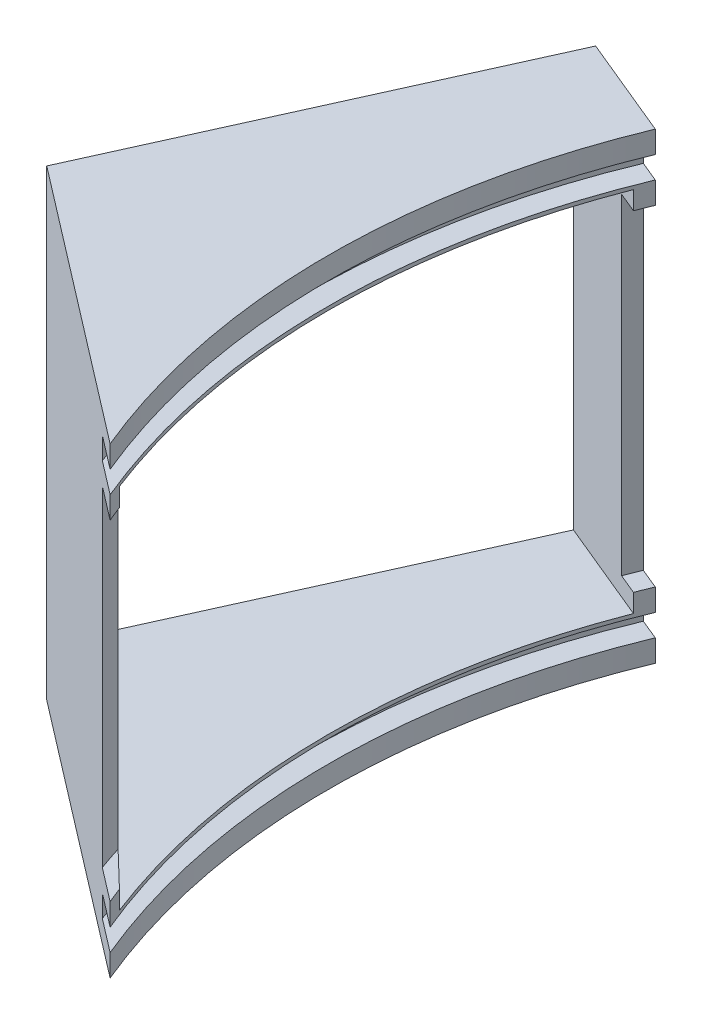
ISO-10303-21;
HEADER;
FILE_DESCRIPTION(('STEP AP214'),'2;1');
FILE_NAME('part.step','',(''),(''),'','','');
FILE_SCHEMA(('AUTOMOTIVE_DESIGN { 1 0 10303 214 1 1 1 1 }'));
ENDSEC;
DATA;
#1=APPLICATION_CONTEXT('core data for automotive mechanical design processes');
#2=APPLICATION_PROTOCOL_DEFINITION('international standard','automotive_design',2000,#1);
#3=PRODUCT_CONTEXT('',#1,'mechanical');
#4=PRODUCT('Part','Part','',(#3));
#5=PRODUCT_RELATED_PRODUCT_CATEGORY('part','',(#4));
#6=PRODUCT_DEFINITION_FORMATION('','',#4);
#7=PRODUCT_DEFINITION_CONTEXT('part definition',#1,'design');
#8=PRODUCT_DEFINITION('design','',#6,#7);
#9=PRODUCT_DEFINITION_SHAPE('','',#8);
#10=(LENGTH_UNIT() NAMED_UNIT(*) SI_UNIT(.MILLI.,.METRE.));
#11=(NAMED_UNIT(*) PLANE_ANGLE_UNIT() SI_UNIT($,.RADIAN.));
#12=(NAMED_UNIT(*) SI_UNIT($,.STERADIAN.) SOLID_ANGLE_UNIT());
#13=UNCERTAINTY_MEASURE_WITH_UNIT(LENGTH_MEASURE(1.E-05),#10,'distance_accuracy_value','');
#14=(GEOMETRIC_REPRESENTATION_CONTEXT(3) GLOBAL_UNCERTAINTY_ASSIGNED_CONTEXT((#13)) GLOBAL_UNIT_ASSIGNED_CONTEXT((#10,
#11,#12)) REPRESENTATION_CONTEXT('',''));
#15=CARTESIAN_POINT('',(0.,0.,0.));
#16=DIRECTION('',(0.,0.,1.));
#17=DIRECTION('',(1.,0.,0.));
#18=AXIS2_PLACEMENT_3D('',#15,#16,#17);
#19=CARTESIAN_POINT('',(-89.6163146535948,22.5,-37.1202929394138));
#20=DIRECTION('',(0.,-1.,0.));
#21=DIRECTION('',(0.,0.,-1.));
#22=AXIS2_PLACEMENT_3D('',#19,#20,#21);
#23=PLANE('',#22);
#24=DIRECTION('',(0.923879532511287,0.,0.382683432365091));
#25=VECTOR('',#24,1.);
#26=CARTESIAN_POINT('',(-90.4903063109859,22.5,-35.0102904267393));
#27=LINE('',#26,#25);
#28=CARTESIAN_POINT('',(-93.2378471168144,22.5,-36.148359091687));
#29=VERTEX_POINT('',#28);
#30=CARTESIAN_POINT('',(-90.4654630231892,22.5,-35.));
#31=VERTEX_POINT('',#30);
#32=EDGE_CURVE('E343',#29,#31,#27,.T.);
#33=ORIENTED_EDGE('',*,*,#32,.F.);
#34=CARTESIAN_POINT('',(0.,22.5,0.));
#35=DIRECTION('',(0.,1.,0.));
#36=DIRECTION('',(0.,0.,1.));
#37=AXIS2_PLACEMENT_3D('',#34,#35,#36);
#38=CIRCLE('',#37,100.);
#39=CARTESIAN_POINT('',(-92.3879532511287,22.5,-38.2683432365091));
#40=VERTEX_POINT('',#39);
#41=EDGE_CURVE('E288',#40,#29,#38,.T.);
#42=ORIENTED_EDGE('',*,*,#41,.F.);
#43=DIRECTION('',(0.923879532511287,0.,0.382683432365091));
#44=VECTOR('',#43,1.);
#45=CARTESIAN_POINT('',(-89.6163146535948,22.5,-37.1202929394138));
#46=LINE('',#45,#44);
#47=CARTESIAN_POINT('',(-89.6163146535948,22.5,-37.1202929394138));
#48=VERTEX_POINT('',#47);
#49=EDGE_CURVE('E245',#40,#48,#46,.T.);
#50=ORIENTED_EDGE('',*,*,#49,.T.);
#51=CARTESIAN_POINT('',(0.,22.5,0.));
#52=DIRECTION('',(0.,1.,0.));
#53=DIRECTION('',(0.,0.,1.));
#54=AXIS2_PLACEMENT_3D('',#51,#52,#53);
#55=CIRCLE('',#54,97.);
#56=EDGE_CURVE('E292',#48,#31,#55,.T.);
#57=ORIENTED_EDGE('',*,*,#56,.T.);
#58=EDGE_LOOP('',(#33,#42,#50,#57));
#59=FACE_BOUND('',#58,.T.);
#60=ADVANCED_FACE('F33',(#59),#23,.T.);
#61=CARTESIAN_POINT('',(0.,55.,0.));
#62=DIRECTION('',(0.,1.,0.));
#63=DIRECTION('',(0.,0.,1.));
#64=AXIS2_PLACEMENT_3D('',#61,#62,#63);
#65=CYLINDRICAL_SURFACE('',#64,100.);
#66=DIRECTION('',(0.,1.,0.));
#67=VECTOR('',#66,1.);
#68=CARTESIAN_POINT('',(-93.2378471168144,55.,-36.148359091687));
#69=LINE('',#68,#67);
#70=CARTESIAN_POINT('',(-93.2378471168144,-22.5,-36.148359091687));
#71=VERTEX_POINT('',#70);
#72=EDGE_CURVE('E341',#71,#29,#69,.T.);
#73=ORIENTED_EDGE('',*,*,#72,.F.);
#74=CARTESIAN_POINT('',(0.,-22.5,0.));
#75=DIRECTION('',(0.,1.,0.));
#76=DIRECTION('',(0.,0.,1.));
#77=AXIS2_PLACEMENT_3D('',#74,#75,#76);
#78=CIRCLE('',#77,100.);
#79=CARTESIAN_POINT('',(-92.3879532511287,-22.5,-38.2683432365091));
#80=VERTEX_POINT('',#79);
#81=EDGE_CURVE('E284',#80,#71,#78,.T.);
#82=ORIENTED_EDGE('',*,*,#81,.F.);
#83=DIRECTION('',(0.,1.,0.));
#84=VECTOR('',#83,1.);
#85=CARTESIAN_POINT('',(-92.3879532511287,22.5,-38.2683432365091));
#86=LINE('',#85,#84);
#87=EDGE_CURVE('E242',#80,#40,#86,.T.);
#88=ORIENTED_EDGE('',*,*,#87,.T.);
#89=ORIENTED_EDGE('',*,*,#41,.T.);
#90=EDGE_LOOP('',(#73,#82,#88,#89));
#91=FACE_BOUND('',#90,.T.);
#92=ADVANCED_FACE('F442',(#91),#65,.F.);
#93=CARTESIAN_POINT('',(-92.3879532511287,-22.5,-38.2683432365091));
#94=DIRECTION('',(0.,1.,0.));
#95=DIRECTION('',(0.,0.,1.));
#96=AXIS2_PLACEMENT_3D('',#93,#94,#95);
#97=PLANE('',#96);
#98=DIRECTION('',(-0.923879532511287,0.,-0.382683432365091));
#99=VECTOR('',#98,1.);
#100=CARTESIAN_POINT('',(-93.2619449085198,-22.5,-36.1583407238346));
#101=LINE('',#100,#99);
#102=CARTESIAN_POINT('',(-90.4654630231892,-22.5,-35.));
#103=VERTEX_POINT('',#102);
#104=EDGE_CURVE('E339',#103,#71,#101,.T.);
#105=ORIENTED_EDGE('',*,*,#104,.F.);
#106=CARTESIAN_POINT('',(0.,-22.5,0.));
#107=DIRECTION('',(0.,1.,0.));
#108=DIRECTION('',(0.,0.,1.));
#109=AXIS2_PLACEMENT_3D('',#106,#107,#108);
#110=CIRCLE('',#109,97.);
#111=CARTESIAN_POINT('',(-89.6163146535948,-22.5,-37.1202929394138));
#112=VERTEX_POINT('',#111);
#113=EDGE_CURVE('E280',#112,#103,#110,.T.);
#114=ORIENTED_EDGE('',*,*,#113,.F.);
#115=DIRECTION('',(-0.923879532511287,0.,-0.382683432365091));
#116=VECTOR('',#115,1.);
#117=CARTESIAN_POINT('',(-92.3879532511287,-22.5,-38.2683432365091));
#118=LINE('',#117,#116);
#119=EDGE_CURVE('E239',#112,#80,#118,.T.);
#120=ORIENTED_EDGE('',*,*,#119,.T.);
#121=ORIENTED_EDGE('',*,*,#81,.T.);
#122=EDGE_LOOP('',(#105,#114,#120,#121));
#123=FACE_BOUND('',#122,.T.);
#124=ADVANCED_FACE('F438',(#123),#97,.T.);
#125=CARTESIAN_POINT('',(-117.332700628933,31.5,-48.6007959103665));
#126=DIRECTION('',(0.,1.,0.));
#127=DIRECTION('',(0.,0.,1.));
#128=AXIS2_PLACEMENT_3D('',#125,#126,#127);
#129=PLANE('',#128);
#130=DIRECTION('',(0.411023274372276,0.,-0.911624850431521));
#131=VECTOR('',#130,1.);
#132=CARTESIAN_POINT('',(-103.474507641264,31.5,-42.8605444248902));
#133=LINE('',#132,#131);
#134=CARTESIAN_POINT('',(-126.704281868358,31.5,8.66169476624683));
#135=VERTEX_POINT('',#134);
#136=CARTESIAN_POINT('',(-103.474507641264,31.5,-42.8605444248902));
#137=VERTEX_POINT('',#136);
#138=EDGE_CURVE('E200',#135,#137,#133,.T.);
#139=ORIENTED_EDGE('',*,*,#138,.F.);
#140=DIRECTION('',(-0.793353340291234,0.,-0.608761429008722));
#141=VECTOR('',#140,1.);
#142=CARTESIAN_POINT('',(-126.704281868358,31.5,8.66169476624683));
#143=LINE('',#142,#141);
#144=CARTESIAN_POINT('',(-89.6163146535948,31.5,37.1202929394138));
#145=VERTEX_POINT('',#144);
#146=EDGE_CURVE('E416',#145,#135,#143,.T.);
#147=ORIENTED_EDGE('',*,*,#146,.F.);
#148=CARTESIAN_POINT('',(0.,31.5,0.));
#149=DIRECTION('',(0.,1.,0.));
#150=DIRECTION('',(0.,0.,1.));
#151=AXIS2_PLACEMENT_3D('',#148,#149,#150);
#152=CIRCLE('',#151,97.);
#153=CARTESIAN_POINT('',(-89.6163146535948,31.5,-37.1202929394138));
#154=VERTEX_POINT('',#153);
#155=EDGE_CURVE('E307',#154,#145,#152,.T.);
#156=ORIENTED_EDGE('',*,*,#155,.F.);
#157=DIRECTION('',(-0.923879532511287,0.,-0.382683432365091));
#158=VECTOR('',#157,1.);
#159=CARTESIAN_POINT('',(-117.332700628933,31.5,-48.6007959103665));
#160=LINE('',#159,#158);
#161=EDGE_CURVE('E263',#154,#137,#160,.T.);
#162=ORIENTED_EDGE('',*,*,#161,.T.);
#163=EDGE_LOOP('',(#139,#147,#156,#162));
#164=FACE_BOUND('',#163,.T.);
#165=ADVANCED_FACE('F35',(#164),#129,.T.);
#166=CARTESIAN_POINT('',(0.,55.,0.));
#167=DIRECTION('',(0.,1.,0.));
#168=DIRECTION('',(0.,0.,1.));
#169=AXIS2_PLACEMENT_3D('',#166,#167,#168);
#170=CYLINDRICAL_SURFACE('',#169,97.);
#171=CARTESIAN_POINT('',(0.,28.5,0.));
#172=DIRECTION('',(0.,1.,0.));
#173=DIRECTION('',(0.,0.,1.));
#174=AXIS2_PLACEMENT_3D('',#171,#172,#173);
#175=CIRCLE('',#174,97.);
#176=CARTESIAN_POINT('',(-89.6163146535948,28.5,-37.1202929394138));
#177=VERTEX_POINT('',#176);
#178=CARTESIAN_POINT('',(-89.6163146535948,28.5,37.1202929394138));
#179=VERTEX_POINT('',#178);
#180=EDGE_CURVE('E304',#177,#179,#175,.T.);
#181=ORIENTED_EDGE('',*,*,#180,.F.);
#182=DIRECTION('',(0.,1.,0.));
#183=VECTOR('',#182,1.);
#184=CARTESIAN_POINT('',(-89.6163146535948,31.5,-37.1202929394138));
#185=LINE('',#184,#183);
#186=EDGE_CURVE('E260',#177,#154,#185,.T.);
#187=ORIENTED_EDGE('',*,*,#186,.T.);
#188=ORIENTED_EDGE('',*,*,#155,.T.);
#189=DIRECTION('',(0.,1.,0.));
#190=VECTOR('',#189,1.);
#191=CARTESIAN_POINT('',(-89.6163146535948,31.5,37.1202929394138));
#192=LINE('',#191,#190);
#193=EDGE_CURVE('E220',#179,#145,#192,.T.);
#194=ORIENTED_EDGE('',*,*,#193,.F.);
#195=EDGE_LOOP('',(#181,#187,#188,#194));
#196=FACE_BOUND('',#195,.T.);
#197=ADVANCED_FACE('F465',(#196),#170,.F.);
#198=CARTESIAN_POINT('',(-89.6163146535948,28.5,-37.1202929394138));
#199=DIRECTION('',(0.,-1.,0.));
#200=DIRECTION('',(0.,0.,-1.));
#201=AXIS2_PLACEMENT_3D('',#198,#199,#200);
#202=PLANE('',#201);
#203=DIRECTION('',(0.793353340291234,0.,0.608761429008722));
#204=VECTOR('',#203,1.);
#205=CARTESIAN_POINT('',(-125.47176428319,28.5,9.60743877250481));
#206=LINE('',#205,#204);
#207=CARTESIAN_POINT('',(-94.17946734075,28.5,33.6188627322909));
#208=VERTEX_POINT('',#207);
#209=EDGE_CURVE('E374',#208,#179,#206,.T.);
#210=ORIENTED_EDGE('',*,*,#209,.F.);
#211=CARTESIAN_POINT('',(0.,28.5,0.));
#212=DIRECTION('',(0.,1.,0.));
#213=DIRECTION('',(0.,0.,1.));
#214=AXIS2_PLACEMENT_3D('',#211,#212,#213);
#215=CIRCLE('',#214,100.);
#216=CARTESIAN_POINT('',(-92.3879532511287,28.5,-38.2683432365091));
#217=VERTEX_POINT('',#216);
#218=EDGE_CURVE('E301',#217,#208,#215,.T.);
#219=ORIENTED_EDGE('',*,*,#218,.F.);
#220=DIRECTION('',(0.923879532511287,0.,0.382683432365091));
#221=VECTOR('',#220,1.);
#222=CARTESIAN_POINT('',(-89.6163146535948,28.5,-37.1202929394138));
#223=LINE('',#222,#221);
#224=EDGE_CURVE('E257',#217,#177,#223,.T.);
#225=ORIENTED_EDGE('',*,*,#224,.T.);
#226=ORIENTED_EDGE('',*,*,#180,.T.);
#227=EDGE_LOOP('',(#210,#219,#225,#226));
#228=FACE_BOUND('',#227,.T.);
#229=ADVANCED_FACE('F463',(#228),#202,.T.);
#230=CARTESIAN_POINT('',(0.,55.,0.));
#231=DIRECTION('',(0.,1.,0.));
#232=DIRECTION('',(0.,0.,1.));
#233=AXIS2_PLACEMENT_3D('',#230,#231,#232);
#234=CYLINDRICAL_SURFACE('',#233,100.);
#235=DIRECTION('',(0.,1.,0.));
#236=VECTOR('',#235,1.);
#237=CARTESIAN_POINT('',(-94.17946734075,55.,33.6188627322909));
#238=LINE('',#237,#236);
#239=CARTESIAN_POINT('',(-94.17946734075,25.5,33.6188627322909));
#240=VERTEX_POINT('',#239);
#241=EDGE_CURVE('E361',#240,#208,#238,.T.);
#242=ORIENTED_EDGE('',*,*,#241,.F.);
#243=CARTESIAN_POINT('',(0.,25.5,0.));
#244=DIRECTION('',(0.,1.,0.));
#245=DIRECTION('',(0.,0.,1.));
#246=AXIS2_PLACEMENT_3D('',#243,#244,#245);
#247=CIRCLE('',#246,100.);
#248=CARTESIAN_POINT('',(-92.3879532511287,25.5,-38.2683432365091));
#249=VERTEX_POINT('',#248);
#250=EDGE_CURVE('E298',#249,#240,#247,.T.);
#251=ORIENTED_EDGE('',*,*,#250,.F.);
#252=DIRECTION('',(0.,1.,0.));
#253=VECTOR('',#252,1.);
#254=CARTESIAN_POINT('',(-92.3879532511287,28.5,-38.2683432365091));
#255=LINE('',#254,#253);
#256=EDGE_CURVE('E254',#249,#217,#255,.T.);
#257=ORIENTED_EDGE('',*,*,#256,.T.);
#258=ORIENTED_EDGE('',*,*,#218,.T.);
#259=EDGE_LOOP('',(#242,#251,#257,#258));
#260=FACE_BOUND('',#259,.T.);
#261=ADVANCED_FACE('F372',(#260),#234,.F.);
#262=CARTESIAN_POINT('',(-92.3879532511287,25.5,-38.2683432365091));
#263=DIRECTION('',(0.,1.,0.));
#264=DIRECTION('',(0.,0.,1.));
#265=AXIS2_PLACEMENT_3D('',#262,#263,#264);
#266=PLANE('',#265);
#267=DIRECTION('',(-0.793353340291234,0.,-0.608761429008722));
#268=VECTOR('',#267,1.);
#269=CARTESIAN_POINT('',(-127.77072572547,25.5,7.84338361352032));
#270=LINE('',#269,#268);
#271=CARTESIAN_POINT('',(-89.6163146535948,25.5,37.1202929394138));
#272=VERTEX_POINT('',#271);
#273=EDGE_CURVE('E352',#272,#240,#270,.T.);
#274=ORIENTED_EDGE('',*,*,#273,.F.);
#275=CARTESIAN_POINT('',(0.,25.5,0.));
#276=DIRECTION('',(0.,1.,0.));
#277=DIRECTION('',(0.,0.,1.));
#278=AXIS2_PLACEMENT_3D('',#275,#276,#277);
#279=CIRCLE('',#278,97.);
#280=CARTESIAN_POINT('',(-89.6163146535948,25.5,-37.1202929394138));
#281=VERTEX_POINT('',#280);
#282=EDGE_CURVE('E295',#281,#272,#279,.T.);
#283=ORIENTED_EDGE('',*,*,#282,.F.);
#284=DIRECTION('',(-0.923879532511287,0.,-0.382683432365091));
#285=VECTOR('',#284,1.);
#286=CARTESIAN_POINT('',(-92.3879532511287,25.5,-38.2683432365091));
#287=LINE('',#286,#285);
#288=EDGE_CURVE('E251',#281,#249,#287,.T.);
#289=ORIENTED_EDGE('',*,*,#288,.T.);
#290=ORIENTED_EDGE('',*,*,#250,.T.);
#291=EDGE_LOOP('',(#274,#283,#289,#290));
#292=FACE_BOUND('',#291,.T.);
#293=ADVANCED_FACE('F360',(#292),#266,.T.);
#294=CARTESIAN_POINT('',(0.,55.,0.));
#295=DIRECTION('',(0.,1.,0.));
#296=DIRECTION('',(0.,0.,1.));
#297=AXIS2_PLACEMENT_3D('',#294,#295,#296);
#298=CYLINDRICAL_SURFACE('',#297,97.);
#299=DIRECTION('',(0.,1.,0.));
#300=VECTOR('',#299,1.);
#301=CARTESIAN_POINT('',(-90.4654630231892,-25.,-35.));
#302=LINE('',#301,#300);
#303=CARTESIAN_POINT('',(-90.4654630231892,25.,-35.));
#304=VERTEX_POINT('',#303);
#305=EDGE_CURVE('E326',#31,#304,#302,.T.);
#306=ORIENTED_EDGE('',*,*,#305,.F.);
#307=ORIENTED_EDGE('',*,*,#56,.F.);
#308=DIRECTION('',(0.,1.,0.));
#309=VECTOR('',#308,1.);
#310=CARTESIAN_POINT('',(-89.6163146535948,25.5,-37.1202929394138));
#311=LINE('',#310,#309);
#312=EDGE_CURVE('E248',#48,#281,#311,.T.);
#313=ORIENTED_EDGE('',*,*,#312,.T.);
#314=ORIENTED_EDGE('',*,*,#282,.T.);
#315=DIRECTION('',(0.,1.,0.));
#316=VECTOR('',#315,1.);
#317=CARTESIAN_POINT('',(-89.6163146535948,25.5,37.1202929394138));
#318=LINE('',#317,#316);
#319=CARTESIAN_POINT('',(-89.6163146535948,22.5,37.1202929394138));
#320=VERTEX_POINT('',#319);
#321=EDGE_CURVE('E224',#320,#272,#318,.T.);
#322=ORIENTED_EDGE('',*,*,#321,.F.);
#323=CARTESIAN_POINT('',(-90.4654630231892,22.5,35.));
#324=VERTEX_POINT('',#323);
#325=EDGE_CURVE('E291',#324,#320,#55,.T.);
#326=ORIENTED_EDGE('',*,*,#325,.F.);
#327=DIRECTION('',(0.,1.,0.));
#328=VECTOR('',#327,1.);
#329=CARTESIAN_POINT('',(-90.4654630231892,-25.,35.));
#330=LINE('',#329,#328);
#331=CARTESIAN_POINT('',(-90.4654630231892,25.,35.));
#332=VERTEX_POINT('',#331);
#333=EDGE_CURVE('E322',#324,#332,#330,.T.);
#334=ORIENTED_EDGE('',*,*,#333,.T.);
#335=CARTESIAN_POINT('',(0.,25.,0.));
#336=DIRECTION('',(0.,-1.,0.));
#337=DIRECTION('',(0.,0.,-1.));
#338=AXIS2_PLACEMENT_3D('',#335,#336,#337);
#339=CIRCLE('',#338,97.);
#340=EDGE_CURVE('E11',#332,#304,#339,.T.);
#341=ORIENTED_EDGE('',*,*,#340,.T.);
#342=EDGE_LOOP('',(#306,#307,#313,#314,#322,#326,#334,#341));
#343=FACE_BOUND('',#342,.T.);
#344=ADVANCED_FACE('F364',(#343),#298,.F.);
#345=DIRECTION('',(0.793353340291234,0.,0.608761429008722));
#346=VECTOR('',#345,1.);
#347=CARTESIAN_POINT('',(-125.47176428319,22.5,9.60743877250481));
#348=LINE('',#347,#346);
#349=CARTESIAN_POINT('',(-94.17946734075,22.5,33.6188627322909));
#350=VERTEX_POINT('',#349);
#351=EDGE_CURVE('E355',#350,#320,#348,.T.);
#352=ORIENTED_EDGE('',*,*,#351,.F.);
#353=CARTESIAN_POINT('',(-95.2752769915698,22.5,30.3746867338523));
#354=VERTEX_POINT('',#353);
#355=EDGE_CURVE('E287',#354,#350,#38,.T.);
#356=ORIENTED_EDGE('',*,*,#355,.F.);
#357=DIRECTION('',(-0.720796216102948,0.,-0.693147036963784));
#358=VECTOR('',#357,1.);
#359=CARTESIAN_POINT('',(-126.056869691246,22.5,0.773851856884049));
#360=LINE('',#359,#358);
#361=EDGE_CURVE('E337',#324,#354,#360,.T.);
#362=ORIENTED_EDGE('',*,*,#361,.F.);
#363=ORIENTED_EDGE('',*,*,#325,.T.);
#364=EDGE_LOOP('',(#352,#356,#362,#363));
#365=FACE_BOUND('',#364,.T.);
#366=ADVANCED_FACE('F393',(#365),#23,.T.);
#367=DIRECTION('',(0.,1.,0.));
#368=VECTOR('',#367,1.);
#369=CARTESIAN_POINT('',(-94.17946734075,55.,33.6188627322909));
#370=LINE('',#369,#368);
#371=CARTESIAN_POINT('',(-94.17946734075,-22.5,33.6188627322909));
#372=VERTEX_POINT('',#371);
#373=EDGE_CURVE('E399',#372,#350,#370,.T.);
#374=ORIENTED_EDGE('',*,*,#373,.F.);
#375=CARTESIAN_POINT('',(-95.2752769915698,-22.5,30.3746867338523));
#376=VERTEX_POINT('',#375);
#377=EDGE_CURVE('E283',#376,#372,#78,.T.);
#378=ORIENTED_EDGE('',*,*,#377,.F.);
#379=DIRECTION('',(0.,1.,0.));
#380=VECTOR('',#379,1.);
#381=CARTESIAN_POINT('',(-95.2752769915698,55.,30.3746867338523));
#382=LINE('',#381,#380);
#383=EDGE_CURVE('E328',#354,#376,#382,.F.);
#384=ORIENTED_EDGE('',*,*,#383,.F.);
#385=ORIENTED_EDGE('',*,*,#355,.T.);
#386=EDGE_LOOP('',(#374,#378,#384,#385));
#387=FACE_BOUND('',#386,.T.);
#388=ADVANCED_FACE('F397',(#387),#65,.F.);
#389=DIRECTION('',(-0.793353340291234,0.,-0.608761429008722));
#390=VECTOR('',#389,1.);
#391=CARTESIAN_POINT('',(-127.77072572547,-22.5,7.84338361352031));
#392=LINE('',#391,#390);
#393=CARTESIAN_POINT('',(-89.6163146535948,-22.5,37.1202929394138));
#394=VERTEX_POINT('',#393);
#395=EDGE_CURVE('E407',#394,#372,#392,.T.);
#396=ORIENTED_EDGE('',*,*,#395,.F.);
#397=CARTESIAN_POINT('',(-90.4654630231892,-22.5,35.));
#398=VERTEX_POINT('',#397);
#399=EDGE_CURVE('E279',#398,#394,#110,.T.);
#400=ORIENTED_EDGE('',*,*,#399,.F.);
#401=DIRECTION('',(0.720796216102948,0.,0.693147036963784));
#402=VECTOR('',#401,1.);
#403=CARTESIAN_POINT('',(-128.070453042306,-22.5,-1.16249201158518));
#404=LINE('',#403,#402);
#405=EDGE_CURVE('E325',#376,#398,#404,.T.);
#406=ORIENTED_EDGE('',*,*,#405,.F.);
#407=ORIENTED_EDGE('',*,*,#377,.T.);
#408=EDGE_LOOP('',(#396,#400,#406,#407));
#409=FACE_BOUND('',#408,.T.);
#410=ADVANCED_FACE('F405',(#409),#97,.T.);
#411=CARTESIAN_POINT('',(0.,55.,0.));
#412=DIRECTION('',(0.,1.,0.));
#413=DIRECTION('',(0.,0.,1.));
#414=AXIS2_PLACEMENT_3D('',#411,#412,#413);
#415=CYLINDRICAL_SURFACE('',#414,97.);
#416=CARTESIAN_POINT('',(-90.4654630231892,-25.,-35.));
#417=VERTEX_POINT('',#416);
#418=EDGE_CURVE('E320',#417,#103,#302,.T.);
#419=ORIENTED_EDGE('',*,*,#418,.F.);
#420=CARTESIAN_POINT('',(0.,-25.,0.));
#421=DIRECTION('',(0.,-1.,0.));
#422=DIRECTION('',(0.,0.,-1.));
#423=AXIS2_PLACEMENT_3D('',#420,#421,#422);
#424=CIRCLE('',#423,97.);
#425=CARTESIAN_POINT('',(-90.4654630231892,-25.,35.));
#426=VERTEX_POINT('',#425);
#427=EDGE_CURVE('E41',#426,#417,#424,.T.);
#428=ORIENTED_EDGE('',*,*,#427,.F.);
#429=EDGE_CURVE('E330',#426,#398,#330,.T.);
#430=ORIENTED_EDGE('',*,*,#429,.T.);
#431=ORIENTED_EDGE('',*,*,#399,.T.);
#432=DIRECTION('',(0.,1.,0.));
#433=VECTOR('',#432,1.);
#434=CARTESIAN_POINT('',(-89.6163146535948,-22.5,37.1202929394138));
#435=LINE('',#434,#433);
#436=CARTESIAN_POINT('',(-89.6163146535948,-25.5,37.1202929394138));
#437=VERTEX_POINT('',#436);
#438=EDGE_CURVE('E347',#437,#394,#435,.T.);
#439=ORIENTED_EDGE('',*,*,#438,.F.);
#440=CARTESIAN_POINT('',(0.,-25.5,0.));
#441=DIRECTION('',(0.,1.,0.));
#442=DIRECTION('',(0.,0.,1.));
#443=AXIS2_PLACEMENT_3D('',#440,#441,#442);
#444=CIRCLE('',#443,97.);
#445=CARTESIAN_POINT('',(-89.6163146535948,-25.5,-37.1202929394138));
#446=VERTEX_POINT('',#445);
#447=EDGE_CURVE('E276',#446,#437,#444,.T.);
#448=ORIENTED_EDGE('',*,*,#447,.F.);
#449=DIRECTION('',(0.,1.,0.));
#450=VECTOR('',#449,1.);
#451=CARTESIAN_POINT('',(-89.6163146535948,-22.5,-37.1202929394138));
#452=LINE('',#451,#450);
#453=EDGE_CURVE('E236',#446,#112,#452,.T.);
#454=ORIENTED_EDGE('',*,*,#453,.T.);
#455=ORIENTED_EDGE('',*,*,#113,.T.);
#456=EDGE_LOOP('',(#419,#428,#430,#431,#439,#448,#454,#455));
#457=FACE_BOUND('',#456,.T.);
#458=ADVANCED_FACE('F324',(#457),#415,.F.);
#459=CARTESIAN_POINT('',(-89.6163146535948,-25.5,-37.1202929394138));
#460=DIRECTION('',(0.,-1.,0.));
#461=DIRECTION('',(0.,0.,-1.));
#462=AXIS2_PLACEMENT_3D('',#459,#460,#461);
#463=PLANE('',#462);
#464=DIRECTION('',(0.793353340291234,0.,0.608761429008722));
#465=VECTOR('',#464,1.);
#466=CARTESIAN_POINT('',(-125.47176428319,-25.5,9.60743877250481));
#467=LINE('',#466,#465);
#468=CARTESIAN_POINT('',(-94.17946734075,-25.5,33.6188627322909));
#469=VERTEX_POINT('',#468);
#470=EDGE_CURVE('E426',#469,#437,#467,.T.);
#471=ORIENTED_EDGE('',*,*,#470,.F.);
#472=CARTESIAN_POINT('',(0.,-25.5,0.));
#473=DIRECTION('',(0.,1.,0.));
#474=DIRECTION('',(0.,0.,1.));
#475=AXIS2_PLACEMENT_3D('',#472,#473,#474);
#476=CIRCLE('',#475,100.);
#477=CARTESIAN_POINT('',(-92.3879532511287,-25.5,-38.2683432365091));
#478=VERTEX_POINT('',#477);
#479=EDGE_CURVE('E273',#478,#469,#476,.T.);
#480=ORIENTED_EDGE('',*,*,#479,.F.);
#481=DIRECTION('',(0.923879532511287,0.,0.382683432365091));
#482=VECTOR('',#481,1.);
#483=CARTESIAN_POINT('',(-89.6163146535948,-25.5,-37.1202929394138));
#484=LINE('',#483,#482);
#485=EDGE_CURVE('E233',#478,#446,#484,.T.);
#486=ORIENTED_EDGE('',*,*,#485,.T.);
#487=ORIENTED_EDGE('',*,*,#447,.T.);
#488=EDGE_LOOP('',(#471,#480,#486,#487));
#489=FACE_BOUND('',#488,.T.);
#490=ADVANCED_FACE('F432',(#489),#463,.T.);
#491=CARTESIAN_POINT('',(0.,55.,0.));
#492=DIRECTION('',(0.,1.,0.));
#493=DIRECTION('',(0.,0.,1.));
#494=AXIS2_PLACEMENT_3D('',#491,#492,#493);
#495=CYLINDRICAL_SURFACE('',#494,100.);
#496=DIRECTION('',(0.,1.,0.));
#497=VECTOR('',#496,1.);
#498=CARTESIAN_POINT('',(-94.17946734075,55.,33.6188627322909));
#499=LINE('',#498,#497);
#500=CARTESIAN_POINT('',(-94.17946734075,-28.5,33.6188627322909));
#501=VERTEX_POINT('',#500);
#502=EDGE_CURVE('E424',#501,#469,#499,.T.);
#503=ORIENTED_EDGE('',*,*,#502,.F.);
#504=CARTESIAN_POINT('',(0.,-28.5,0.));
#505=DIRECTION('',(0.,1.,0.));
#506=DIRECTION('',(0.,0.,1.));
#507=AXIS2_PLACEMENT_3D('',#504,#505,#506);
#508=CIRCLE('',#507,100.);
#509=CARTESIAN_POINT('',(-92.3879532511287,-28.5,-38.2683432365091));
#510=VERTEX_POINT('',#509);
#511=EDGE_CURVE('E270',#510,#501,#508,.T.);
#512=ORIENTED_EDGE('',*,*,#511,.F.);
#513=DIRECTION('',(0.,1.,0.));
#514=VECTOR('',#513,1.);
#515=CARTESIAN_POINT('',(-92.3879532511287,-25.5,-38.2683432365091));
#516=LINE('',#515,#514);
#517=EDGE_CURVE('E230',#510,#478,#516,.T.);
#518=ORIENTED_EDGE('',*,*,#517,.T.);
#519=ORIENTED_EDGE('',*,*,#479,.T.);
#520=EDGE_LOOP('',(#503,#512,#518,#519));
#521=FACE_BOUND('',#520,.T.);
#522=ADVANCED_FACE('F484',(#521),#495,.F.);
#523=CARTESIAN_POINT('',(-92.3879532511287,-28.5,-38.2683432365091));
#524=DIRECTION('',(0.,1.,0.));
#525=DIRECTION('',(0.,0.,1.));
#526=AXIS2_PLACEMENT_3D('',#523,#524,#525);
#527=PLANE('',#526);
#528=DIRECTION('',(-0.793353340291234,0.,-0.608761429008722));
#529=VECTOR('',#528,1.);
#530=CARTESIAN_POINT('',(-127.77072572547,-28.5,7.84338361352031));
#531=LINE('',#530,#529);
#532=CARTESIAN_POINT('',(-89.6163146535948,-28.5,37.1202929394138));
#533=VERTEX_POINT('',#532);
#534=EDGE_CURVE('E422',#533,#501,#531,.T.);
#535=ORIENTED_EDGE('',*,*,#534,.F.);
#536=CARTESIAN_POINT('',(0.,-28.5,0.));
#537=DIRECTION('',(0.,1.,0.));
#538=DIRECTION('',(0.,0.,1.));
#539=AXIS2_PLACEMENT_3D('',#536,#537,#538);
#540=CIRCLE('',#539,97.);
#541=CARTESIAN_POINT('',(-89.6163146535948,-28.5,-37.1202929394138));
#542=VERTEX_POINT('',#541);
#543=EDGE_CURVE('E267',#542,#533,#540,.T.);
#544=ORIENTED_EDGE('',*,*,#543,.F.);
#545=DIRECTION('',(-0.923879532511287,0.,-0.382683432365091));
#546=VECTOR('',#545,1.);
#547=CARTESIAN_POINT('',(-92.3879532511287,-28.5,-38.2683432365091));
#548=LINE('',#547,#546);
#549=EDGE_CURVE('E222',#542,#510,#548,.T.);
#550=ORIENTED_EDGE('',*,*,#549,.T.);
#551=ORIENTED_EDGE('',*,*,#511,.T.);
#552=EDGE_LOOP('',(#535,#544,#550,#551));
#553=FACE_BOUND('',#552,.T.);
#554=ADVANCED_FACE('F481',(#553),#527,.T.);
#555=CARTESIAN_POINT('',(0.,55.,0.));
#556=DIRECTION('',(0.,1.,0.));
#557=DIRECTION('',(0.,0.,1.));
#558=AXIS2_PLACEMENT_3D('',#555,#556,#557);
#559=CYLINDRICAL_SURFACE('',#558,97.);
#560=CARTESIAN_POINT('',(0.,-31.5,0.));
#561=DIRECTION('',(0.,1.,0.));
#562=DIRECTION('',(0.,0.,1.));
#563=AXIS2_PLACEMENT_3D('',#560,#561,#562);
#564=CIRCLE('',#563,97.);
#565=CARTESIAN_POINT('',(-89.6163146535948,-31.5,-37.1202929394138));
#566=VERTEX_POINT('',#565);
#567=CARTESIAN_POINT('',(-89.6163146535948,-31.5,37.1202929394138));
#568=VERTEX_POINT('',#567);
#569=EDGE_CURVE('E265',#566,#568,#564,.T.);
#570=ORIENTED_EDGE('',*,*,#569,.F.);
#571=DIRECTION('',(0.,1.,0.));
#572=VECTOR('',#571,1.);
#573=CARTESIAN_POINT('',(-89.6163146535948,-28.5,-37.1202929394138));
#574=LINE('',#573,#572);
#575=EDGE_CURVE('E219',#566,#542,#574,.T.);
#576=ORIENTED_EDGE('',*,*,#575,.T.);
#577=ORIENTED_EDGE('',*,*,#543,.T.);
#578=DIRECTION('',(0.,1.,0.));
#579=VECTOR('',#578,1.);
#580=CARTESIAN_POINT('',(-89.6163146535948,-28.5,37.1202929394138));
#581=LINE('',#580,#579);
#582=EDGE_CURVE('E345',#568,#533,#581,.T.);
#583=ORIENTED_EDGE('',*,*,#582,.F.);
#584=EDGE_LOOP('',(#570,#576,#577,#583));
#585=FACE_BOUND('',#584,.T.);
#586=ADVANCED_FACE('F479',(#585),#559,.F.);
#587=CARTESIAN_POINT('',(-89.6163146535948,-31.5,-37.1202929394138));
#588=DIRECTION('',(0.,-1.,0.));
#589=DIRECTION('',(0.,0.,-1.));
#590=AXIS2_PLACEMENT_3D('',#587,#588,#589);
#591=PLANE('',#590);
#592=DIRECTION('',(0.411023274372276,0.,-0.911624850431521));
#593=VECTOR('',#592,1.);
#594=CARTESIAN_POINT('',(-103.474507641264,-31.5,-42.8605444248902));
#595=LINE('',#594,#593);
#596=CARTESIAN_POINT('',(-126.704281868358,-31.5,8.66169476624683));
#597=VERTEX_POINT('',#596);
#598=CARTESIAN_POINT('',(-103.474507641264,-31.5,-42.8605444248902));
#599=VERTEX_POINT('',#598);
#600=EDGE_CURVE('E197',#597,#599,#595,.T.);
#601=ORIENTED_EDGE('',*,*,#600,.T.);
#602=DIRECTION('',(0.923879532511287,0.,0.382683432365091));
#603=VECTOR('',#602,1.);
#604=CARTESIAN_POINT('',(-89.6163146535948,-31.5,-37.1202929394138));
#605=LINE('',#604,#603);
#606=EDGE_CURVE('E211',#599,#566,#605,.T.);
#607=ORIENTED_EDGE('',*,*,#606,.T.);
#608=ORIENTED_EDGE('',*,*,#569,.T.);
#609=DIRECTION('',(-0.793353340291234,0.,-0.608761429008722));
#610=VECTOR('',#609,1.);
#611=CARTESIAN_POINT('',(-126.704281868358,-31.5,8.66169476624683));
#612=LINE('',#611,#610);
#613=EDGE_CURVE('E213',#568,#597,#612,.T.);
#614=ORIENTED_EDGE('',*,*,#613,.T.);
#615=EDGE_LOOP('',(#601,#607,#608,#614));
#616=FACE_BOUND('',#615,.T.);
#617=ADVANCED_FACE('F209',(#616),#591,.T.);
#618=CARTESIAN_POINT('',(0.,0.,0.));
#619=DIRECTION('',(0.382683432365091,0.,-0.923879532511287));
#620=DIRECTION('',(-0.923879532511287,0.,-0.382683432365091));
#621=AXIS2_PLACEMENT_3D('',#618,#619,#620);
#622=PLANE('',#621);
#623=DIRECTION('',(0.,1.,0.));
#624=VECTOR('',#623,1.);
#625=CARTESIAN_POINT('',(-103.474507641264,-31.5,-42.8605444248902));
#626=LINE('',#625,#624);
#627=EDGE_CURVE('E194',#599,#137,#626,.T.);
#628=ORIENTED_EDGE('',*,*,#627,.T.);
#629=ORIENTED_EDGE('',*,*,#161,.F.);
#630=ORIENTED_EDGE('',*,*,#186,.F.);
#631=ORIENTED_EDGE('',*,*,#224,.F.);
#632=ORIENTED_EDGE('',*,*,#256,.F.);
#633=ORIENTED_EDGE('',*,*,#288,.F.);
#634=ORIENTED_EDGE('',*,*,#312,.F.);
#635=ORIENTED_EDGE('',*,*,#49,.F.);
#636=ORIENTED_EDGE('',*,*,#87,.F.);
#637=ORIENTED_EDGE('',*,*,#119,.F.);
#638=ORIENTED_EDGE('',*,*,#453,.F.);
#639=ORIENTED_EDGE('',*,*,#485,.F.);
#640=ORIENTED_EDGE('',*,*,#517,.F.);
#641=ORIENTED_EDGE('',*,*,#549,.F.);
#642=ORIENTED_EDGE('',*,*,#575,.F.);
#643=ORIENTED_EDGE('',*,*,#606,.F.);
#644=EDGE_LOOP('',(#628,#629,#630,#631,#632,#633,#634,#635,#636,#637,#638,#639,#640,#641,#642,#643));
#645=FACE_BOUND('',#644,.T.);
#646=ADVANCED_FACE('F216',(#645),#622,.T.);
#647=CARTESIAN_POINT('',(-127.,-25.,-50.1331007108164));
#648=DIRECTION('',(0.382683432365091,0.,-0.923879532511286));
#649=DIRECTION('',(-0.923879532511287,0.,-0.382683432365091));
#650=AXIS2_PLACEMENT_3D('',#647,#648,#649);
#651=PLANE('',#650);
#652=DIRECTION('',(-0.923879532511286,0.,-0.382683432365091));
#653=VECTOR('',#652,1.);
#654=CARTESIAN_POINT('',(-127.,25.,-50.1331007108164));
#655=LINE('',#654,#653);
#656=CARTESIAN_POINT('',(-104.413670917646,25.,-40.7775368806833));
#657=VERTEX_POINT('',#656);
#658=EDGE_CURVE('E333',#304,#657,#655,.T.);
#659=ORIENTED_EDGE('',*,*,#658,.T.);
#660=DIRECTION('',(0.,-1.,0.));
#661=VECTOR('',#660,1.);
#662=CARTESIAN_POINT('',(-104.413670917646,-25.,-40.7775368806833));
#663=LINE('',#662,#661);
#664=CARTESIAN_POINT('',(-104.413670917646,-25.,-40.7775368806833));
#665=VERTEX_POINT('',#664);
#666=EDGE_CURVE('E48',#657,#665,#663,.T.);
#667=ORIENTED_EDGE('',*,*,#666,.T.);
#668=DIRECTION('',(-0.923879532511286,0.,-0.382683432365091));
#669=VECTOR('',#668,1.);
#670=CARTESIAN_POINT('',(-127.,-25.,-50.1331007108164));
#671=LINE('',#670,#669);
#672=EDGE_CURVE('E313',#417,#665,#671,.T.);
#673=ORIENTED_EDGE('',*,*,#672,.F.);
#674=ORIENTED_EDGE('',*,*,#418,.T.);
#675=ORIENTED_EDGE('',*,*,#104,.T.);
#676=ORIENTED_EDGE('',*,*,#72,.T.);
#677=ORIENTED_EDGE('',*,*,#32,.T.);
#678=ORIENTED_EDGE('',*,*,#305,.T.);
#679=EDGE_LOOP('',(#659,#667,#673,#674,#675,#676,#677,#678));
#680=FACE_BOUND('',#679,.T.);
#681=ADVANCED_FACE('F319',(#680),#651,.F.);
#682=CARTESIAN_POINT('',(-90.4654630231892,-25.,35.));
#683=DIRECTION('',(-0.693147036963784,0.,0.720796216102948));
#684=DIRECTION('',(0.720796216102948,0.,0.693147036963784));
#685=AXIS2_PLACEMENT_3D('',#682,#683,#684);
#686=PLANE('',#685);
#687=DIRECTION('',(0.720796216102948,0.,0.693147036963784));
#688=VECTOR('',#687,1.);
#689=CARTESIAN_POINT('',(-90.4654630231892,-25.,35.));
#690=LINE('',#689,#688);
#691=CARTESIAN_POINT('',(-124.027695813129,-25.,2.72518821198522));
#692=VERTEX_POINT('',#691);
#693=EDGE_CURVE('E56',#692,#426,#690,.T.);
#694=ORIENTED_EDGE('',*,*,#693,.F.);
#695=DIRECTION('',(0.,1.,0.));
#696=VECTOR('',#695,1.);
#697=CARTESIAN_POINT('',(-124.027695813129,-25.,2.72518821198522));
#698=LINE('',#697,#696);
#699=CARTESIAN_POINT('',(-124.027695813129,25.,2.72518821198523));
#700=VERTEX_POINT('',#699);
#701=EDGE_CURVE('E409',#692,#700,#698,.T.);
#702=ORIENTED_EDGE('',*,*,#701,.T.);
#703=DIRECTION('',(0.720796216102948,0.,0.693147036963784));
#704=VECTOR('',#703,1.);
#705=CARTESIAN_POINT('',(-90.4654630231892,25.,35.));
#706=LINE('',#705,#704);
#707=EDGE_CURVE('E376',#700,#332,#706,.T.);
#708=ORIENTED_EDGE('',*,*,#707,.T.);
#709=ORIENTED_EDGE('',*,*,#333,.F.);
#710=ORIENTED_EDGE('',*,*,#361,.T.);
#711=ORIENTED_EDGE('',*,*,#383,.T.);
#712=ORIENTED_EDGE('',*,*,#405,.T.);
#713=ORIENTED_EDGE('',*,*,#429,.F.);
#714=EDGE_LOOP('',(#694,#702,#708,#709,#710,#711,#712,#713));
#715=FACE_BOUND('',#714,.T.);
#716=ADVANCED_FACE('F389',(#715),#686,.F.);
#717=CARTESIAN_POINT('',(0.,-25.,0.));
#718=DIRECTION('',(0.,-1.,0.));
#719=DIRECTION('',(0.,0.,-1.));
#720=AXIS2_PLACEMENT_3D('',#717,#718,#719);
#721=PLANE('',#720);
#722=ORIENTED_EDGE('',*,*,#672,.T.);
#723=DIRECTION('',(-0.411023274372276,0.,0.911624850431521));
#724=VECTOR('',#723,1.);
#725=CARTESIAN_POINT('',(-102.053315119026,-25.,-46.0126637847931));
#726=LINE('',#725,#724);
#727=EDGE_CURVE('E411',#665,#692,#726,.T.);
#728=ORIENTED_EDGE('',*,*,#727,.T.);
#729=ORIENTED_EDGE('',*,*,#693,.T.);
#730=ORIENTED_EDGE('',*,*,#427,.T.);
#731=EDGE_LOOP('',(#722,#728,#729,#730));
#732=FACE_BOUND('',#731,.T.);
#733=ADVANCED_FACE('F312',(#732),#721,.F.);
#734=CARTESIAN_POINT('',(0.,25.,0.));
#735=DIRECTION('',(0.,-1.,0.));
#736=DIRECTION('',(0.,0.,-1.));
#737=AXIS2_PLACEMENT_3D('',#734,#735,#736);
#738=PLANE('',#737);
#739=DIRECTION('',(-0.411023274372276,0.,0.911624850431521));
#740=VECTOR('',#739,1.);
#741=CARTESIAN_POINT('',(-102.053315119026,25.,-46.0126637847931));
#742=LINE('',#741,#740);
#743=EDGE_CURVE('E205',#657,#700,#742,.T.);
#744=ORIENTED_EDGE('',*,*,#743,.F.);
#745=ORIENTED_EDGE('',*,*,#658,.F.);
#746=ORIENTED_EDGE('',*,*,#340,.F.);
#747=ORIENTED_EDGE('',*,*,#707,.F.);
#748=EDGE_LOOP('',(#744,#745,#746,#747));
#749=FACE_BOUND('',#748,.T.);
#750=ADVANCED_FACE('F386',(#749),#738,.T.);
#751=CARTESIAN_POINT('',(-126.704281868358,-31.5,8.66169476624683));
#752=DIRECTION('',(0.608761429008722,0.,-0.793353340291234));
#753=DIRECTION('',(-0.793353340291234,0.,-0.608761429008722));
#754=AXIS2_PLACEMENT_3D('',#751,#752,#753);
#755=PLANE('',#754);
#756=ORIENTED_EDGE('',*,*,#209,.T.);
#757=ORIENTED_EDGE('',*,*,#193,.T.);
#758=ORIENTED_EDGE('',*,*,#146,.T.);
#759=DIRECTION('',(0.,1.,0.));
#760=VECTOR('',#759,1.);
#761=CARTESIAN_POINT('',(-126.704281868358,-31.5,8.66169476624683));
#762=LINE('',#761,#760);
#763=EDGE_CURVE('E418',#597,#135,#762,.T.);
#764=ORIENTED_EDGE('',*,*,#763,.F.);
#765=ORIENTED_EDGE('',*,*,#613,.F.);
#766=ORIENTED_EDGE('',*,*,#582,.T.);
#767=ORIENTED_EDGE('',*,*,#534,.T.);
#768=ORIENTED_EDGE('',*,*,#502,.T.);
#769=ORIENTED_EDGE('',*,*,#470,.T.);
#770=ORIENTED_EDGE('',*,*,#438,.T.);
#771=ORIENTED_EDGE('',*,*,#395,.T.);
#772=ORIENTED_EDGE('',*,*,#373,.T.);
#773=ORIENTED_EDGE('',*,*,#351,.T.);
#774=ORIENTED_EDGE('',*,*,#321,.T.);
#775=ORIENTED_EDGE('',*,*,#273,.T.);
#776=ORIENTED_EDGE('',*,*,#241,.T.);
#777=EDGE_LOOP('',(#756,#757,#758,#764,#765,#766,#767,#768,#769,#770,#771,#772,#773,#774,#775,#776));
#778=FACE_BOUND('',#777,.T.);
#779=ADVANCED_FACE('F351',(#778),#755,.F.);
#780=CARTESIAN_POINT('',(-103.474507641264,-31.5,-42.8605444248902));
#781=DIRECTION('',(0.911624850431521,0.,0.411023274372276));
#782=DIRECTION('',(0.411023274372276,0.,-0.911624850431521));
#783=AXIS2_PLACEMENT_3D('',#780,#781,#782);
#784=PLANE('',#783);
#785=ORIENTED_EDGE('',*,*,#138,.T.);
#786=ORIENTED_EDGE('',*,*,#627,.F.);
#787=ORIENTED_EDGE('',*,*,#600,.F.);
#788=ORIENTED_EDGE('',*,*,#763,.T.);
#789=EDGE_LOOP('',(#785,#786,#787,#788));
#790=FACE_BOUND('',#789,.T.);
#791=ORIENTED_EDGE('',*,*,#666,.F.);
#792=ORIENTED_EDGE('',*,*,#743,.T.);
#793=ORIENTED_EDGE('',*,*,#701,.F.);
#794=ORIENTED_EDGE('',*,*,#727,.F.);
#795=EDGE_LOOP('',(#791,#792,#793,#794));
#796=FACE_BOUND('',#795,.T.);
#797=ADVANCED_FACE('F196',(#790,#796),#784,.F.);
#798=CLOSED_SHELL('',(#60,#92,#124,#165,#197,#229,#261,#293,#344,#366,#388,#410,#458,#490,#522,
#554,#586,#617,#646,#681,#716,#733,#750,#779,#797));
#799=MANIFOLD_SOLID_BREP('B2',#798);
#800=ADVANCED_BREP_SHAPE_REPRESENTATION('',(#18,#799),#14);
#801=SHAPE_DEFINITION_REPRESENTATION(#9,#800);
ENDSEC;
END-ISO-10303-21;
